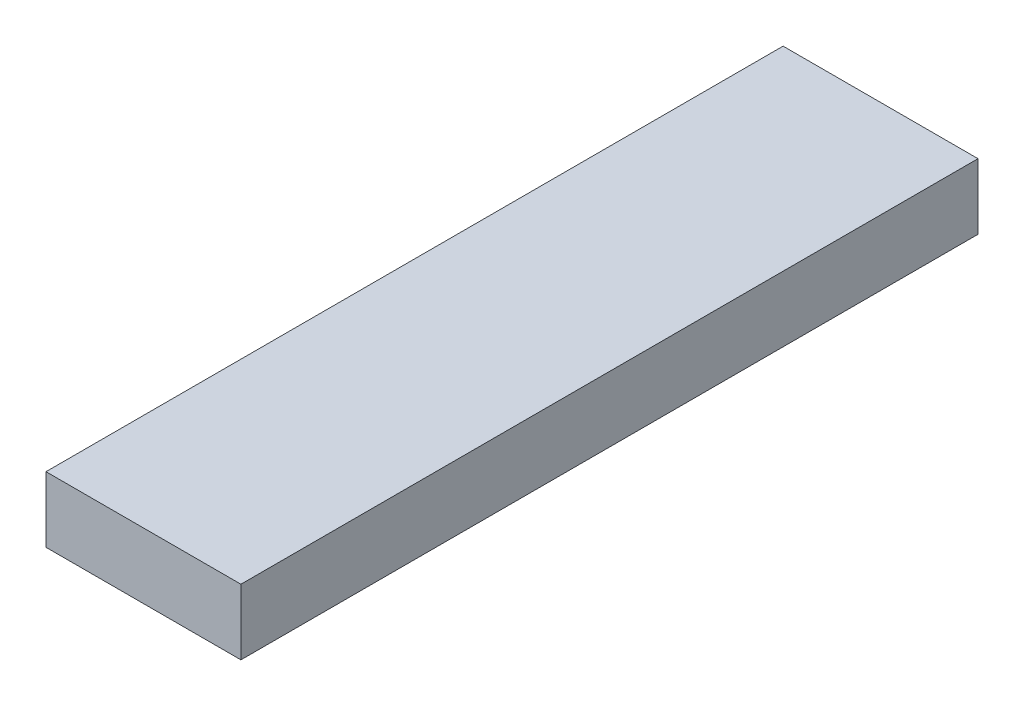
ISO-10303-21;
HEADER;
FILE_DESCRIPTION(('STEP AP214'),'2;1');
FILE_NAME('part.step','',(''),(''),'','','');
FILE_SCHEMA(('AUTOMOTIVE_DESIGN { 1 0 10303 214 1 1 1 1 }'));
ENDSEC;
DATA;
#1=APPLICATION_CONTEXT('core data for automotive mechanical design processes');
#2=APPLICATION_PROTOCOL_DEFINITION('international standard','automotive_design',2000,#1);
#3=PRODUCT_CONTEXT('',#1,'mechanical');
#4=PRODUCT('Part','Part','',(#3));
#5=PRODUCT_RELATED_PRODUCT_CATEGORY('part','',(#4));
#6=PRODUCT_DEFINITION_FORMATION('','',#4);
#7=PRODUCT_DEFINITION_CONTEXT('part definition',#1,'design');
#8=PRODUCT_DEFINITION('design','',#6,#7);
#9=PRODUCT_DEFINITION_SHAPE('','',#8);
#10=(LENGTH_UNIT() NAMED_UNIT(*) SI_UNIT(.MILLI.,.METRE.));
#11=(NAMED_UNIT(*) PLANE_ANGLE_UNIT() SI_UNIT($,.RADIAN.));
#12=(NAMED_UNIT(*) SI_UNIT($,.STERADIAN.) SOLID_ANGLE_UNIT());
#13=UNCERTAINTY_MEASURE_WITH_UNIT(LENGTH_MEASURE(1.E-05),#10,'distance_accuracy_value','');
#14=(GEOMETRIC_REPRESENTATION_CONTEXT(3) GLOBAL_UNCERTAINTY_ASSIGNED_CONTEXT((#13)) GLOBAL_UNIT_ASSIGNED_CONTEXT((#10,
#11,#12)) REPRESENTATION_CONTEXT('',''));
#15=CARTESIAN_POINT('',(0.,0.,0.));
#16=DIRECTION('',(0.,0.,1.));
#17=DIRECTION('',(1.,0.,0.));
#18=AXIS2_PLACEMENT_3D('',#15,#16,#17);
#19=CARTESIAN_POINT('',(-5.95,4.,-22.5));
#20=DIRECTION('',(1.,0.,0.));
#21=DIRECTION('',(0.,0.,-1.));
#22=AXIS2_PLACEMENT_3D('',#19,#20,#21);
#23=PLANE('',#22);
#24=DIRECTION('',(0.,0.,1.));
#25=VECTOR('',#24,1.);
#26=CARTESIAN_POINT('',(-5.95,0.,-22.5));
#27=LINE('',#26,#25);
#28=CARTESIAN_POINT('',(-5.95,0.,-22.5));
#29=VERTEX_POINT('',#28);
#30=CARTESIAN_POINT('',(-5.95,0.,22.5));
#31=VERTEX_POINT('',#30);
#32=EDGE_CURVE('E107',#29,#31,#27,.T.);
#33=ORIENTED_EDGE('',*,*,#32,.T.);
#34=DIRECTION('',(0.,-1.,0.));
#35=VECTOR('',#34,1.);
#36=CARTESIAN_POINT('',(-5.95,4.,22.5));
#37=LINE('',#36,#35);
#38=CARTESIAN_POINT('',(-5.95,4.,22.5));
#39=VERTEX_POINT('',#38);
#40=EDGE_CURVE('E11',#39,#31,#37,.T.);
#41=ORIENTED_EDGE('',*,*,#40,.F.);
#42=DIRECTION('',(0.,0.,1.));
#43=VECTOR('',#42,1.);
#44=CARTESIAN_POINT('',(-5.95,4.,-22.5));
#45=LINE('',#44,#43);
#46=CARTESIAN_POINT('',(-5.95,4.,-22.5));
#47=VERTEX_POINT('',#46);
#48=EDGE_CURVE('E91',#47,#39,#45,.T.);
#49=ORIENTED_EDGE('',*,*,#48,.F.);
#50=DIRECTION('',(0.,-1.,0.));
#51=VECTOR('',#50,1.);
#52=CARTESIAN_POINT('',(-5.95,4.,-22.5));
#53=LINE('',#52,#51);
#54=EDGE_CURVE('E103',#47,#29,#53,.T.);
#55=ORIENTED_EDGE('',*,*,#54,.T.);
#56=EDGE_LOOP('',(#33,#41,#49,#55));
#57=FACE_BOUND('',#56,.T.);
#58=ADVANCED_FACE('F39',(#57),#23,.F.);
#59=CARTESIAN_POINT('',(5.95,4.,22.5));
#60=DIRECTION('',(0.,0.,-1.));
#61=DIRECTION('',(-1.,0.,0.));
#62=AXIS2_PLACEMENT_3D('',#59,#60,#61);
#63=PLANE('',#62);
#64=DIRECTION('',(1.,0.,0.));
#65=VECTOR('',#64,1.);
#66=CARTESIAN_POINT('',(5.95,0.,22.5));
#67=LINE('',#66,#65);
#68=CARTESIAN_POINT('',(5.95,0.,22.5));
#69=VERTEX_POINT('',#68);
#70=EDGE_CURVE('E96',#31,#69,#67,.T.);
#71=ORIENTED_EDGE('',*,*,#70,.T.);
#72=DIRECTION('',(0.,-1.,0.));
#73=VECTOR('',#72,1.);
#74=CARTESIAN_POINT('',(5.95,4.,22.5));
#75=LINE('',#74,#73);
#76=CARTESIAN_POINT('',(5.95,4.,22.5));
#77=VERTEX_POINT('',#76);
#78=EDGE_CURVE('E48',#77,#69,#75,.T.);
#79=ORIENTED_EDGE('',*,*,#78,.F.);
#80=DIRECTION('',(1.,0.,0.));
#81=VECTOR('',#80,1.);
#82=CARTESIAN_POINT('',(5.95,4.,22.5));
#83=LINE('',#82,#81);
#84=EDGE_CURVE('E86',#39,#77,#83,.T.);
#85=ORIENTED_EDGE('',*,*,#84,.F.);
#86=ORIENTED_EDGE('',*,*,#40,.T.);
#87=EDGE_LOOP('',(#71,#79,#85,#86));
#88=FACE_BOUND('',#87,.T.);
#89=ADVANCED_FACE('F95',(#88),#63,.F.);
#90=CARTESIAN_POINT('',(5.95,4.,-22.5));
#91=DIRECTION('',(-1.,0.,0.));
#92=DIRECTION('',(0.,0.,1.));
#93=AXIS2_PLACEMENT_3D('',#90,#91,#92);
#94=PLANE('',#93);
#95=DIRECTION('',(0.,0.,-1.));
#96=VECTOR('',#95,1.);
#97=CARTESIAN_POINT('',(5.95,0.,-22.5));
#98=LINE('',#97,#96);
#99=CARTESIAN_POINT('',(5.95,0.,-22.5));
#100=VERTEX_POINT('',#99);
#101=EDGE_CURVE('E73',#69,#100,#98,.T.);
#102=ORIENTED_EDGE('',*,*,#101,.T.);
#103=DIRECTION('',(0.,-1.,0.));
#104=VECTOR('',#103,1.);
#105=CARTESIAN_POINT('',(5.95,4.,-22.5));
#106=LINE('',#105,#104);
#107=CARTESIAN_POINT('',(5.95,4.,-22.5));
#108=VERTEX_POINT('',#107);
#109=EDGE_CURVE('E98',#108,#100,#106,.T.);
#110=ORIENTED_EDGE('',*,*,#109,.F.);
#111=DIRECTION('',(0.,0.,-1.));
#112=VECTOR('',#111,1.);
#113=CARTESIAN_POINT('',(5.95,4.,-22.5));
#114=LINE('',#113,#112);
#115=EDGE_CURVE('E89',#77,#108,#114,.T.);
#116=ORIENTED_EDGE('',*,*,#115,.F.);
#117=ORIENTED_EDGE('',*,*,#78,.T.);
#118=EDGE_LOOP('',(#102,#110,#116,#117));
#119=FACE_BOUND('',#118,.T.);
#120=ADVANCED_FACE('F99',(#119),#94,.F.);
#121=CARTESIAN_POINT('',(5.95,4.,-22.5));
#122=DIRECTION('',(0.,0.,1.));
#123=DIRECTION('',(1.,0.,0.));
#124=AXIS2_PLACEMENT_3D('',#121,#122,#123);
#125=PLANE('',#124);
#126=DIRECTION('',(-1.,0.,0.));
#127=VECTOR('',#126,1.);
#128=CARTESIAN_POINT('',(5.95,0.,-22.5));
#129=LINE('',#128,#127);
#130=EDGE_CURVE('E79',#100,#29,#129,.T.);
#131=ORIENTED_EDGE('',*,*,#130,.T.);
#132=ORIENTED_EDGE('',*,*,#54,.F.);
#133=DIRECTION('',(-1.,0.,0.));
#134=VECTOR('',#133,1.);
#135=CARTESIAN_POINT('',(5.95,4.,-22.5));
#136=LINE('',#135,#134);
#137=EDGE_CURVE('E56',#108,#47,#136,.T.);
#138=ORIENTED_EDGE('',*,*,#137,.F.);
#139=ORIENTED_EDGE('',*,*,#109,.T.);
#140=EDGE_LOOP('',(#131,#132,#138,#139));
#141=FACE_BOUND('',#140,.T.);
#142=ADVANCED_FACE('F120',(#141),#125,.F.);
#143=CARTESIAN_POINT('',(0.,4.,0.));
#144=DIRECTION('',(0.,-1.,0.));
#145=DIRECTION('',(0.,0.,-1.));
#146=AXIS2_PLACEMENT_3D('',#143,#144,#145);
#147=PLANE('',#146);
#148=ORIENTED_EDGE('',*,*,#48,.T.);
#149=ORIENTED_EDGE('',*,*,#84,.T.);
#150=ORIENTED_EDGE('',*,*,#115,.T.);
#151=ORIENTED_EDGE('',*,*,#137,.T.);
#152=EDGE_LOOP('',(#148,#149,#150,#151));
#153=FACE_BOUND('',#152,.T.);
#154=ADVANCED_FACE('F87',(#153),#147,.F.);
#155=CARTESIAN_POINT('',(0.,0.,0.));
#156=DIRECTION('',(0.,-1.,0.));
#157=DIRECTION('',(0.,0.,-1.));
#158=AXIS2_PLACEMENT_3D('',#155,#156,#157);
#159=PLANE('',#158);
#160=ORIENTED_EDGE('',*,*,#32,.F.);
#161=ORIENTED_EDGE('',*,*,#130,.F.);
#162=ORIENTED_EDGE('',*,*,#101,.F.);
#163=ORIENTED_EDGE('',*,*,#70,.F.);
#164=EDGE_LOOP('',(#160,#161,#162,#163));
#165=FACE_BOUND('',#164,.T.);
#166=ADVANCED_FACE('F123',(#165),#159,.T.);
#167=CLOSED_SHELL('',(#58,#89,#120,#142,#154,#166));
#168=MANIFOLD_SOLID_BREP('B2',#167);
#169=ADVANCED_BREP_SHAPE_REPRESENTATION('',(#18,#168),#14);
#170=SHAPE_DEFINITION_REPRESENTATION(#9,#169);
ENDSEC;
END-ISO-10303-21;
